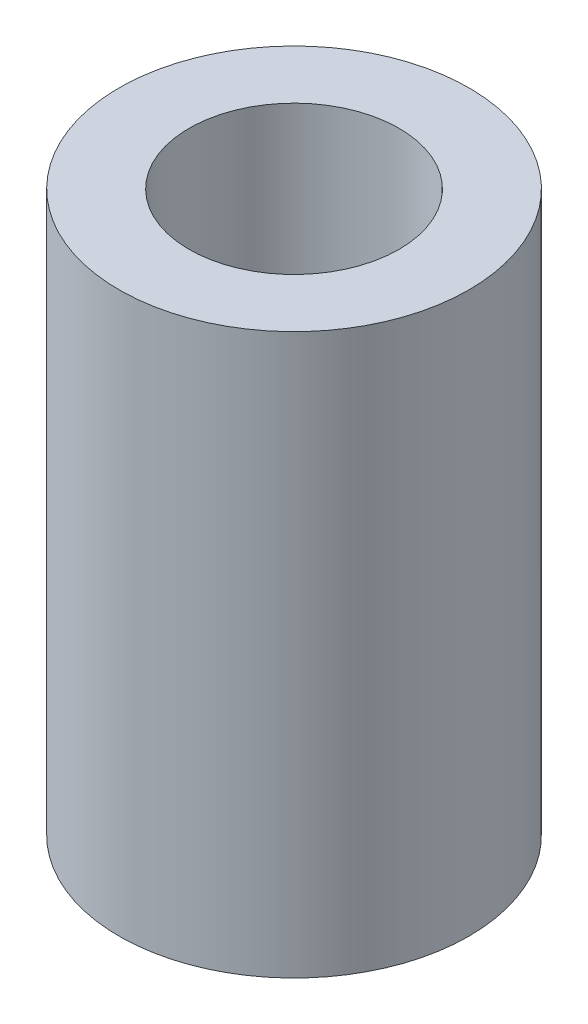
ISO-10303-21;
HEADER;
FILE_DESCRIPTION(('STEP AP214'),'2;1');
FILE_NAME('part.step','',(''),(''),'','','');
FILE_SCHEMA(('AUTOMOTIVE_DESIGN { 1 0 10303 214 1 1 1 1 }'));
ENDSEC;
DATA;
#1=APPLICATION_CONTEXT('core data for automotive mechanical design processes');
#2=APPLICATION_PROTOCOL_DEFINITION('international standard','automotive_design',2000,#1);
#3=PRODUCT_CONTEXT('',#1,'mechanical');
#4=PRODUCT('Part','Part','',(#3));
#5=PRODUCT_RELATED_PRODUCT_CATEGORY('part','',(#4));
#6=PRODUCT_DEFINITION_FORMATION('','',#4);
#7=PRODUCT_DEFINITION_CONTEXT('part definition',#1,'design');
#8=PRODUCT_DEFINITION('design','',#6,#7);
#9=PRODUCT_DEFINITION_SHAPE('','',#8);
#10=(LENGTH_UNIT() NAMED_UNIT(*) SI_UNIT(.MILLI.,.METRE.));
#11=(NAMED_UNIT(*) PLANE_ANGLE_UNIT() SI_UNIT($,.RADIAN.));
#12=(NAMED_UNIT(*) SI_UNIT($,.STERADIAN.) SOLID_ANGLE_UNIT());
#13=UNCERTAINTY_MEASURE_WITH_UNIT(LENGTH_MEASURE(1.E-05),#10,'distance_accuracy_value','');
#14=(GEOMETRIC_REPRESENTATION_CONTEXT(3) GLOBAL_UNCERTAINTY_ASSIGNED_CONTEXT((#13)) GLOBAL_UNIT_ASSIGNED_CONTEXT((#10,
#11,#12)) REPRESENTATION_CONTEXT('',''));
#15=CARTESIAN_POINT('',(0.,0.,0.));
#16=DIRECTION('',(0.,0.,1.));
#17=DIRECTION('',(1.,0.,0.));
#18=AXIS2_PLACEMENT_3D('',#15,#16,#17);
#19=CARTESIAN_POINT('',(0.,24.,0.));
#20=DIRECTION('',(0.,1.,0.));
#21=DIRECTION('',(0.,0.,1.));
#22=AXIS2_PLACEMENT_3D('',#19,#20,#21);
#23=PLANE('',#22);
#24=CARTESIAN_POINT('',(0.,24.,0.));
#25=DIRECTION('',(0.,1.,0.));
#26=DIRECTION('',(1.,0.,0.));
#27=AXIS2_PLACEMENT_3D('',#24,#25,#26);
#28=CIRCLE('',#27,7.5);
#29=CARTESIAN_POINT('',(7.5,24.,0.));
#30=VERTEX_POINT('',#29);
#31=EDGE_CURVE('E11',#30,#30,#28,.T.);
#32=ORIENTED_EDGE('',*,*,#31,.T.);
#33=EDGE_LOOP('',(#32));
#34=FACE_BOUND('',#33,.T.);
#35=CARTESIAN_POINT('',(0.,24.,0.));
#36=DIRECTION('',(0.,1.,0.));
#37=DIRECTION('',(1.,0.,0.));
#38=AXIS2_PLACEMENT_3D('',#35,#36,#37);
#39=CIRCLE('',#38,4.5);
#40=CARTESIAN_POINT('',(4.5,24.,0.));
#41=VERTEX_POINT('',#40);
#42=EDGE_CURVE('E64',#41,#41,#39,.T.);
#43=ORIENTED_EDGE('',*,*,#42,.F.);
#44=EDGE_LOOP('',(#43));
#45=FACE_BOUND('',#44,.T.);
#46=ADVANCED_FACE('F51',(#34,#45),#23,.T.);
#47=CARTESIAN_POINT('',(0.,0.,0.));
#48=DIRECTION('',(0.,1.,0.));
#49=DIRECTION('',(0.,0.,1.));
#50=AXIS2_PLACEMENT_3D('',#47,#48,#49);
#51=PLANE('',#50);
#52=CARTESIAN_POINT('',(0.,0.,0.));
#53=DIRECTION('',(0.,1.,0.));
#54=DIRECTION('',(1.,0.,0.));
#55=AXIS2_PLACEMENT_3D('',#52,#53,#54);
#56=CIRCLE('',#55,7.5);
#57=CARTESIAN_POINT('',(7.5,0.,0.));
#58=VERTEX_POINT('',#57);
#59=EDGE_CURVE('E55',#58,#58,#56,.T.);
#60=ORIENTED_EDGE('',*,*,#59,.F.);
#61=EDGE_LOOP('',(#60));
#62=FACE_BOUND('',#61,.T.);
#63=CARTESIAN_POINT('',(0.,0.,0.));
#64=DIRECTION('',(0.,1.,0.));
#65=DIRECTION('',(1.,0.,0.));
#66=AXIS2_PLACEMENT_3D('',#63,#64,#65);
#67=CIRCLE('',#66,4.5);
#68=CARTESIAN_POINT('',(4.5,0.,0.));
#69=VERTEX_POINT('',#68);
#70=EDGE_CURVE('E66',#69,#69,#67,.T.);
#71=ORIENTED_EDGE('',*,*,#70,.T.);
#72=EDGE_LOOP('',(#71));
#73=FACE_BOUND('',#72,.T.);
#74=ADVANCED_FACE('F78',(#62,#73),#51,.F.);
#75=CARTESIAN_POINT('',(0.,24.,0.));
#76=DIRECTION('',(0.,-1.,0.));
#77=DIRECTION('',(0.,0.,-1.));
#78=AXIS2_PLACEMENT_3D('',#75,#76,#77);
#79=CYLINDRICAL_SURFACE('',#78,7.5);
#80=ORIENTED_EDGE('',*,*,#31,.F.);
#81=EDGE_LOOP('',(#80));
#82=FACE_BOUND('',#81,.T.);
#83=ORIENTED_EDGE('',*,*,#59,.T.);
#84=EDGE_LOOP('',(#83));
#85=FACE_BOUND('',#84,.T.);
#86=ADVANCED_FACE('F53',(#82,#85),#79,.T.);
#87=CARTESIAN_POINT('',(0.,24.,0.));
#88=DIRECTION('',(0.,-1.,0.));
#89=DIRECTION('',(0.,0.,-1.));
#90=AXIS2_PLACEMENT_3D('',#87,#88,#89);
#91=CYLINDRICAL_SURFACE('',#90,4.5);
#92=ORIENTED_EDGE('',*,*,#42,.T.);
#93=EDGE_LOOP('',(#92));
#94=FACE_BOUND('',#93,.T.);
#95=ORIENTED_EDGE('',*,*,#70,.F.);
#96=EDGE_LOOP('',(#95));
#97=FACE_BOUND('',#96,.T.);
#98=ADVANCED_FACE('F74',(#94,#97),#91,.F.);
#99=CLOSED_SHELL('',(#46,#74,#86,#98));
#100=MANIFOLD_SOLID_BREP('B2',#99);
#101=ADVANCED_BREP_SHAPE_REPRESENTATION('',(#18,#100),#14);
#102=SHAPE_DEFINITION_REPRESENTATION(#9,#101);
ENDSEC;
END-ISO-10303-21;
